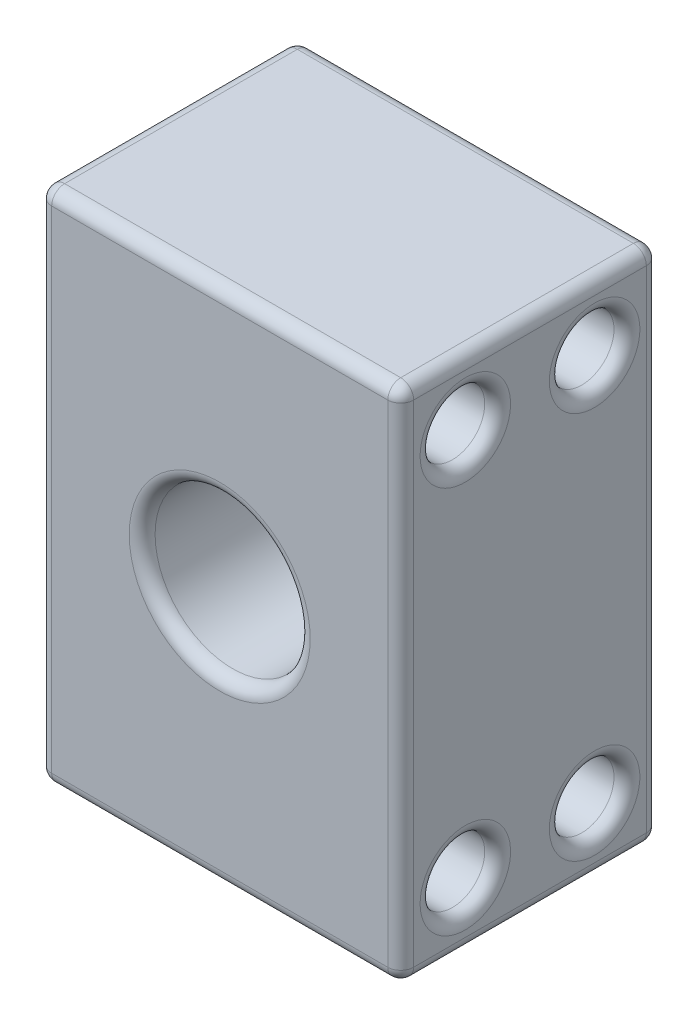
ISO-10303-21;
HEADER;
FILE_DESCRIPTION(('STEP AP214'),'2;1');
FILE_NAME('part.step','',(''),(''),'','','');
FILE_SCHEMA(('AUTOMOTIVE_DESIGN { 1 0 10303 214 1 1 1 1 }'));
ENDSEC;
DATA;
#1=APPLICATION_CONTEXT('core data for automotive mechanical design processes');
#2=APPLICATION_PROTOCOL_DEFINITION('international standard','automotive_design',2000,#1);
#3=PRODUCT_CONTEXT('',#1,'mechanical');
#4=PRODUCT('Part','Part','',(#3));
#5=PRODUCT_RELATED_PRODUCT_CATEGORY('part','',(#4));
#6=PRODUCT_DEFINITION_FORMATION('','',#4);
#7=PRODUCT_DEFINITION_CONTEXT('part definition',#1,'design');
#8=PRODUCT_DEFINITION('design','',#6,#7);
#9=PRODUCT_DEFINITION_SHAPE('','',#8);
#10=(LENGTH_UNIT() NAMED_UNIT(*) SI_UNIT(.MILLI.,.METRE.));
#11=(NAMED_UNIT(*) PLANE_ANGLE_UNIT() SI_UNIT($,.RADIAN.));
#12=(NAMED_UNIT(*) SI_UNIT($,.STERADIAN.) SOLID_ANGLE_UNIT());
#13=UNCERTAINTY_MEASURE_WITH_UNIT(LENGTH_MEASURE(1.E-05),#10,'distance_accuracy_value','');
#14=(GEOMETRIC_REPRESENTATION_CONTEXT(3) GLOBAL_UNCERTAINTY_ASSIGNED_CONTEXT((#13)) GLOBAL_UNIT_ASSIGNED_CONTEXT((#10,
#11,#12)) REPRESENTATION_CONTEXT('',''));
#15=CARTESIAN_POINT('',(0.,0.,0.));
#16=DIRECTION('',(0.,0.,1.));
#17=DIRECTION('',(1.,0.,0.));
#18=AXIS2_PLACEMENT_3D('',#15,#16,#17);
#19=CARTESIAN_POINT('',(0.,0.,20.));
#20=DIRECTION('',(1.,0.,0.));
#21=DIRECTION('',(0.,0.,-1.));
#22=AXIS2_PLACEMENT_3D('',#19,#20,#21);
#23=PLANE('',#22);
#24=CARTESIAN_POINT('',(0.,35.,15.));
#25=DIRECTION('',(1.,0.,0.));
#26=DIRECTION('',(0.,0.,-1.));
#27=AXIS2_PLACEMENT_3D('',#24,#25,#26);
#28=CIRCLE('',#27,3.5);
#29=CARTESIAN_POINT('',(0.,35.,11.5));
#30=VERTEX_POINT('',#29);
#31=EDGE_CURVE('E171',#30,#30,#28,.T.);
#32=ORIENTED_EDGE('',*,*,#31,.T.);
#33=EDGE_LOOP('',(#32));
#34=FACE_BOUND('',#33,.T.);
#35=CARTESIAN_POINT('',(0.,35.,5.));
#36=DIRECTION('',(1.,0.,0.));
#37=DIRECTION('',(0.,0.,-1.));
#38=AXIS2_PLACEMENT_3D('',#35,#36,#37);
#39=CIRCLE('',#38,3.5);
#40=CARTESIAN_POINT('',(0.,35.,1.5));
#41=VERTEX_POINT('',#40);
#42=EDGE_CURVE('E168',#41,#41,#39,.T.);
#43=ORIENTED_EDGE('',*,*,#42,.T.);
#44=EDGE_LOOP('',(#43));
#45=FACE_BOUND('',#44,.T.);
#46=CARTESIAN_POINT('',(0.,5.,5.));
#47=DIRECTION('',(1.,0.,0.));
#48=DIRECTION('',(0.,0.,-1.));
#49=AXIS2_PLACEMENT_3D('',#46,#47,#48);
#50=CIRCLE('',#49,3.5);
#51=CARTESIAN_POINT('',(0.,5.,1.5));
#52=VERTEX_POINT('',#51);
#53=EDGE_CURVE('E165',#52,#52,#50,.T.);
#54=ORIENTED_EDGE('',*,*,#53,.T.);
#55=EDGE_LOOP('',(#54));
#56=FACE_BOUND('',#55,.T.);
#57=CARTESIAN_POINT('',(0.,5.,15.));
#58=DIRECTION('',(1.,0.,0.));
#59=DIRECTION('',(0.,0.,-1.));
#60=AXIS2_PLACEMENT_3D('',#57,#58,#59);
#61=CIRCLE('',#60,3.5);
#62=CARTESIAN_POINT('',(0.,5.,11.5));
#63=VERTEX_POINT('',#62);
#64=EDGE_CURVE('E159',#63,#63,#61,.T.);
#65=ORIENTED_EDGE('',*,*,#64,.T.);
#66=EDGE_LOOP('',(#65));
#67=FACE_BOUND('',#66,.T.);
#68=DIRECTION('',(0.,-1.,0.));
#69=VECTOR('',#68,1.);
#70=CARTESIAN_POINT('',(0.,0.,1.));
#71=LINE('',#70,#69);
#72=CARTESIAN_POINT('',(0.,39.,1.));
#73=VERTEX_POINT('',#72);
#74=CARTESIAN_POINT('',(0.,1.,1.));
#75=VERTEX_POINT('',#74);
#76=EDGE_CURVE('E154',#73,#75,#71,.T.);
#77=ORIENTED_EDGE('',*,*,#76,.T.);
#78=DIRECTION('',(0.,0.,-1.));
#79=VECTOR('',#78,1.);
#80=CARTESIAN_POINT('',(0.,1.,20.));
#81=LINE('',#80,#79);
#82=CARTESIAN_POINT('',(0.,1.,19.));
#83=VERTEX_POINT('',#82);
#84=EDGE_CURVE('E157',#75,#83,#81,.F.);
#85=ORIENTED_EDGE('',*,*,#84,.T.);
#86=DIRECTION('',(0.,-1.,0.));
#87=VECTOR('',#86,1.);
#88=CARTESIAN_POINT('',(0.,0.,19.));
#89=LINE('',#88,#87);
#90=CARTESIAN_POINT('',(0.,39.,19.));
#91=VERTEX_POINT('',#90);
#92=EDGE_CURVE('E142',#83,#91,#89,.F.);
#93=ORIENTED_EDGE('',*,*,#92,.T.);
#94=DIRECTION('',(0.,0.,-1.));
#95=VECTOR('',#94,1.);
#96=CARTESIAN_POINT('',(0.,39.,20.));
#97=LINE('',#96,#95);
#98=EDGE_CURVE('E148',#91,#73,#97,.T.);
#99=ORIENTED_EDGE('',*,*,#98,.T.);
#100=EDGE_LOOP('',(#77,#85,#93,#99));
#101=FACE_BOUND('',#100,.T.);
#102=ADVANCED_FACE('F37',(#34,#45,#56,#67,#101),#23,.F.);
#103=CARTESIAN_POINT('',(0.,0.,20.));
#104=DIRECTION('',(0.,1.,0.));
#105=DIRECTION('',(0.,0.,1.));
#106=AXIS2_PLACEMENT_3D('',#103,#104,#105);
#107=PLANE('',#106);
#108=DIRECTION('',(1.,0.,0.));
#109=VECTOR('',#108,1.);
#110=CARTESIAN_POINT('',(0.,0.,19.));
#111=LINE('',#110,#109);
#112=CARTESIAN_POINT('',(27.,0.,19.));
#113=VERTEX_POINT('',#112);
#114=CARTESIAN_POINT('',(1.,0.,19.));
#115=VERTEX_POINT('',#114);
#116=EDGE_CURVE('E252',#113,#115,#111,.F.);
#117=ORIENTED_EDGE('',*,*,#116,.T.);
#118=DIRECTION('',(0.,0.,-1.));
#119=VECTOR('',#118,1.);
#120=CARTESIAN_POINT('',(1.,0.,20.));
#121=LINE('',#120,#119);
#122=CARTESIAN_POINT('',(1.,0.,1.));
#123=VERTEX_POINT('',#122);
#124=EDGE_CURVE('E254',#115,#123,#121,.T.);
#125=ORIENTED_EDGE('',*,*,#124,.T.);
#126=DIRECTION('',(1.,0.,0.));
#127=VECTOR('',#126,1.);
#128=CARTESIAN_POINT('',(28.,0.,1.));
#129=LINE('',#128,#127);
#130=CARTESIAN_POINT('',(27.,0.,1.));
#131=VERTEX_POINT('',#130);
#132=EDGE_CURVE('E248',#123,#131,#129,.T.);
#133=ORIENTED_EDGE('',*,*,#132,.T.);
#134=DIRECTION('',(0.,0.,-1.));
#135=VECTOR('',#134,1.);
#136=CARTESIAN_POINT('',(27.,0.,20.));
#137=LINE('',#136,#135);
#138=EDGE_CURVE('E250',#131,#113,#137,.F.);
#139=ORIENTED_EDGE('',*,*,#138,.T.);
#140=EDGE_LOOP('',(#117,#125,#133,#139));
#141=FACE_BOUND('',#140,.T.);
#142=ADVANCED_FACE('F329',(#141),#107,.F.);
#143=CARTESIAN_POINT('',(28.,0.,20.));
#144=DIRECTION('',(-1.,0.,0.));
#145=DIRECTION('',(0.,0.,1.));
#146=AXIS2_PLACEMENT_3D('',#143,#144,#145);
#147=PLANE('',#146);
#148=CARTESIAN_POINT('',(28.,35.,15.));
#149=DIRECTION('',(-1.,0.,0.));
#150=DIRECTION('',(0.,0.,1.));
#151=AXIS2_PLACEMENT_3D('',#148,#149,#150);
#152=CIRCLE('',#151,3.5);
#153=CARTESIAN_POINT('',(28.,35.,18.5));
#154=VERTEX_POINT('',#153);
#155=EDGE_CURVE('E216',#154,#154,#152,.T.);
#156=ORIENTED_EDGE('',*,*,#155,.T.);
#157=EDGE_LOOP('',(#156));
#158=FACE_BOUND('',#157,.T.);
#159=CARTESIAN_POINT('',(28.,35.,5.));
#160=DIRECTION('',(-1.,0.,0.));
#161=DIRECTION('',(0.,0.,1.));
#162=AXIS2_PLACEMENT_3D('',#159,#160,#161);
#163=CIRCLE('',#162,3.5);
#164=CARTESIAN_POINT('',(28.,35.,8.5));
#165=VERTEX_POINT('',#164);
#166=EDGE_CURVE('E213',#165,#165,#163,.T.);
#167=ORIENTED_EDGE('',*,*,#166,.T.);
#168=EDGE_LOOP('',(#167));
#169=FACE_BOUND('',#168,.T.);
#170=CARTESIAN_POINT('',(28.,5.,5.));
#171=DIRECTION('',(-1.,0.,0.));
#172=DIRECTION('',(0.,0.,1.));
#173=AXIS2_PLACEMENT_3D('',#170,#171,#172);
#174=CIRCLE('',#173,3.5);
#175=CARTESIAN_POINT('',(28.,5.,8.5));
#176=VERTEX_POINT('',#175);
#177=EDGE_CURVE('E210',#176,#176,#174,.T.);
#178=ORIENTED_EDGE('',*,*,#177,.T.);
#179=EDGE_LOOP('',(#178));
#180=FACE_BOUND('',#179,.T.);
#181=CARTESIAN_POINT('',(28.,5.,15.));
#182=DIRECTION('',(-1.,0.,0.));
#183=DIRECTION('',(0.,0.,1.));
#184=AXIS2_PLACEMENT_3D('',#181,#182,#183);
#185=CIRCLE('',#184,3.5);
#186=CARTESIAN_POINT('',(28.,5.,18.5));
#187=VERTEX_POINT('',#186);
#188=EDGE_CURVE('E207',#187,#187,#185,.T.);
#189=ORIENTED_EDGE('',*,*,#188,.T.);
#190=EDGE_LOOP('',(#189));
#191=FACE_BOUND('',#190,.T.);
#192=DIRECTION('',(0.,1.,0.));
#193=VECTOR('',#192,1.);
#194=CARTESIAN_POINT('',(28.,0.,19.));
#195=LINE('',#194,#193);
#196=CARTESIAN_POINT('',(28.,39.,19.));
#197=VERTEX_POINT('',#196);
#198=CARTESIAN_POINT('',(28.,1.,19.));
#199=VERTEX_POINT('',#198);
#200=EDGE_CURVE('E202',#197,#199,#195,.F.);
#201=ORIENTED_EDGE('',*,*,#200,.T.);
#202=DIRECTION('',(0.,0.,-1.));
#203=VECTOR('',#202,1.);
#204=CARTESIAN_POINT('',(28.,1.,20.));
#205=LINE('',#204,#203);
#206=CARTESIAN_POINT('',(28.,1.,1.));
#207=VERTEX_POINT('',#206);
#208=EDGE_CURVE('E205',#199,#207,#205,.T.);
#209=ORIENTED_EDGE('',*,*,#208,.T.);
#210=DIRECTION('',(0.,1.,0.));
#211=VECTOR('',#210,1.);
#212=CARTESIAN_POINT('',(28.,40.,1.));
#213=LINE('',#212,#211);
#214=CARTESIAN_POINT('',(28.,39.,1.));
#215=VERTEX_POINT('',#214);
#216=EDGE_CURVE('E200',#207,#215,#213,.T.);
#217=ORIENTED_EDGE('',*,*,#216,.T.);
#218=DIRECTION('',(0.,0.,-1.));
#219=VECTOR('',#218,1.);
#220=CARTESIAN_POINT('',(28.,39.,20.));
#221=LINE('',#220,#219);
#222=EDGE_CURVE('E198',#215,#197,#221,.F.);
#223=ORIENTED_EDGE('',*,*,#222,.T.);
#224=EDGE_LOOP('',(#201,#209,#217,#223));
#225=FACE_BOUND('',#224,.T.);
#226=ADVANCED_FACE('F362',(#158,#169,#180,#191,#225),#147,.F.);
#227=CARTESIAN_POINT('',(0.,40.,20.));
#228=DIRECTION('',(0.,-1.,0.));
#229=DIRECTION('',(0.,0.,-1.));
#230=AXIS2_PLACEMENT_3D('',#227,#228,#229);
#231=PLANE('',#230);
#232=DIRECTION('',(-1.,0.,0.));
#233=VECTOR('',#232,1.);
#234=CARTESIAN_POINT('',(0.,40.,19.));
#235=LINE('',#234,#233);
#236=CARTESIAN_POINT('',(1.,40.,19.));
#237=VERTEX_POINT('',#236);
#238=CARTESIAN_POINT('',(27.,40.,19.));
#239=VERTEX_POINT('',#238);
#240=EDGE_CURVE('E46',#237,#239,#235,.F.);
#241=ORIENTED_EDGE('',*,*,#240,.T.);
#242=DIRECTION('',(0.,0.,-1.));
#243=VECTOR('',#242,1.);
#244=CARTESIAN_POINT('',(27.,40.,20.));
#245=LINE('',#244,#243);
#246=CARTESIAN_POINT('',(27.,40.,1.));
#247=VERTEX_POINT('',#246);
#248=EDGE_CURVE('E11',#239,#247,#245,.T.);
#249=ORIENTED_EDGE('',*,*,#248,.T.);
#250=DIRECTION('',(-1.,0.,0.));
#251=VECTOR('',#250,1.);
#252=CARTESIAN_POINT('',(0.,40.,1.));
#253=LINE('',#252,#251);
#254=CARTESIAN_POINT('',(1.,40.,1.));
#255=VERTEX_POINT('',#254);
#256=EDGE_CURVE('E257',#247,#255,#253,.T.);
#257=ORIENTED_EDGE('',*,*,#256,.T.);
#258=DIRECTION('',(0.,0.,-1.));
#259=VECTOR('',#258,1.);
#260=CARTESIAN_POINT('',(1.,40.,20.));
#261=LINE('',#260,#259);
#262=EDGE_CURVE('E57',#255,#237,#261,.F.);
#263=ORIENTED_EDGE('',*,*,#262,.T.);
#264=EDGE_LOOP('',(#241,#249,#257,#263));
#265=FACE_BOUND('',#264,.T.);
#266=ADVANCED_FACE('F378',(#265),#231,.F.);
#267=CARTESIAN_POINT('',(0.,0.,20.));
#268=DIRECTION('',(0.,0.,-1.));
#269=DIRECTION('',(-1.,0.,0.));
#270=AXIS2_PLACEMENT_3D('',#267,#268,#269);
#271=PLANE('',#270);
#272=CARTESIAN_POINT('',(14.,20.,20.));
#273=DIRECTION('',(0.,0.,-1.));
#274=DIRECTION('',(-1.,0.,0.));
#275=AXIS2_PLACEMENT_3D('',#272,#273,#274);
#276=CIRCLE('',#275,7.);
#277=CARTESIAN_POINT('',(7.,20.,20.));
#278=VERTEX_POINT('',#277);
#279=EDGE_CURVE('E236',#278,#278,#276,.T.);
#280=ORIENTED_EDGE('',*,*,#279,.T.);
#281=EDGE_LOOP('',(#280));
#282=FACE_BOUND('',#281,.T.);
#283=DIRECTION('',(0.,-1.,0.));
#284=VECTOR('',#283,1.);
#285=CARTESIAN_POINT('',(1.,0.,20.));
#286=LINE('',#285,#284);
#287=CARTESIAN_POINT('',(1.,39.,20.));
#288=VERTEX_POINT('',#287);
#289=CARTESIAN_POINT('',(1.,1.,20.));
#290=VERTEX_POINT('',#289);
#291=EDGE_CURVE('E144',#288,#290,#286,.T.);
#292=ORIENTED_EDGE('',*,*,#291,.T.);
#293=DIRECTION('',(1.,0.,0.));
#294=VECTOR('',#293,1.);
#295=CARTESIAN_POINT('',(0.,1.,20.));
#296=LINE('',#295,#294);
#297=CARTESIAN_POINT('',(27.,1.,20.));
#298=VERTEX_POINT('',#297);
#299=EDGE_CURVE('E234',#290,#298,#296,.T.);
#300=ORIENTED_EDGE('',*,*,#299,.T.);
#301=DIRECTION('',(0.,1.,0.));
#302=VECTOR('',#301,1.);
#303=CARTESIAN_POINT('',(27.,0.,20.));
#304=LINE('',#303,#302);
#305=CARTESIAN_POINT('',(27.,39.,20.));
#306=VERTEX_POINT('',#305);
#307=EDGE_CURVE('E231',#298,#306,#304,.T.);
#308=ORIENTED_EDGE('',*,*,#307,.T.);
#309=DIRECTION('',(-1.,0.,0.));
#310=VECTOR('',#309,1.);
#311=CARTESIAN_POINT('',(0.,39.,20.));
#312=LINE('',#311,#310);
#313=EDGE_CURVE('E228',#306,#288,#312,.T.);
#314=ORIENTED_EDGE('',*,*,#313,.T.);
#315=EDGE_LOOP('',(#292,#300,#308,#314));
#316=FACE_BOUND('',#315,.T.);
#317=ADVANCED_FACE('F345',(#282,#316),#271,.F.);
#318=CARTESIAN_POINT('',(0.,0.,0.));
#319=DIRECTION('',(0.,0.,-1.));
#320=DIRECTION('',(-1.,0.,0.));
#321=AXIS2_PLACEMENT_3D('',#318,#319,#320);
#322=PLANE('',#321);
#323=DIRECTION('',(0.,1.,0.));
#324=VECTOR('',#323,1.);
#325=CARTESIAN_POINT('',(27.,0.,0.));
#326=LINE('',#325,#324);
#327=CARTESIAN_POINT('',(27.,39.,0.));
#328=VERTEX_POINT('',#327);
#329=CARTESIAN_POINT('',(27.,1.,0.));
#330=VERTEX_POINT('',#329);
#331=EDGE_CURVE('E243',#328,#330,#326,.F.);
#332=ORIENTED_EDGE('',*,*,#331,.T.);
#333=DIRECTION('',(1.,0.,0.));
#334=VECTOR('',#333,1.);
#335=CARTESIAN_POINT('',(0.,1.,0.));
#336=LINE('',#335,#334);
#337=CARTESIAN_POINT('',(1.,1.,0.));
#338=VERTEX_POINT('',#337);
#339=EDGE_CURVE('E246',#330,#338,#336,.F.);
#340=ORIENTED_EDGE('',*,*,#339,.T.);
#341=DIRECTION('',(0.,-1.,0.));
#342=VECTOR('',#341,1.);
#343=CARTESIAN_POINT('',(1.,40.,0.));
#344=LINE('',#343,#342);
#345=CARTESIAN_POINT('',(1.,39.,0.));
#346=VERTEX_POINT('',#345);
#347=EDGE_CURVE('E241',#338,#346,#344,.F.);
#348=ORIENTED_EDGE('',*,*,#347,.T.);
#349=DIRECTION('',(-1.,0.,0.));
#350=VECTOR('',#349,1.);
#351=CARTESIAN_POINT('',(28.,39.,0.));
#352=LINE('',#351,#350);
#353=EDGE_CURVE('E239',#346,#328,#352,.F.);
#354=ORIENTED_EDGE('',*,*,#353,.T.);
#355=EDGE_LOOP('',(#332,#340,#348,#354));
#356=FACE_BOUND('',#355,.T.);
#357=ADVANCED_FACE('F385',(#356),#322,.T.);
#358=CARTESIAN_POINT('',(14.,20.,8.));
#359=DIRECTION('',(0.,0.,1.));
#360=DIRECTION('',(1.,0.,0.));
#361=AXIS2_PLACEMENT_3D('',#358,#359,#360);
#362=CYLINDRICAL_SURFACE('',#361,6.);
#363=CARTESIAN_POINT('',(14.,20.,9.));
#364=DIRECTION('',(0.,0.,1.));
#365=DIRECTION('',(1.,0.,0.));
#366=AXIS2_PLACEMENT_3D('',#363,#364,#365);
#367=CIRCLE('',#366,6.);
#368=CARTESIAN_POINT('',(20.,20.,9.));
#369=VERTEX_POINT('',#368);
#370=EDGE_CURVE('E225',#369,#369,#367,.F.);
#371=ORIENTED_EDGE('',*,*,#370,.T.);
#372=EDGE_LOOP('',(#371));
#373=FACE_BOUND('',#372,.T.);
#374=CARTESIAN_POINT('',(14.,20.,19.));
#375=DIRECTION('',(0.,0.,-1.));
#376=DIRECTION('',(-1.,0.,0.));
#377=AXIS2_PLACEMENT_3D('',#374,#375,#376);
#378=CIRCLE('',#377,6.);
#379=CARTESIAN_POINT('',(8.,20.,19.));
#380=VERTEX_POINT('',#379);
#381=EDGE_CURVE('E222',#380,#380,#378,.F.);
#382=ORIENTED_EDGE('',*,*,#381,.T.);
#383=EDGE_LOOP('',(#382));
#384=FACE_BOUND('',#383,.T.);
#385=ADVANCED_FACE('F699',(#373,#384),#362,.F.);
#386=CARTESIAN_POINT('',(14.,20.,8.));
#387=DIRECTION('',(0.,0.,1.));
#388=DIRECTION('',(1.,0.,0.));
#389=AXIS2_PLACEMENT_3D('',#386,#387,#388);
#390=PLANE('',#389);
#391=CARTESIAN_POINT('',(14.,20.,8.));
#392=DIRECTION('',(0.,0.,1.));
#393=DIRECTION('',(1.,0.,0.));
#394=AXIS2_PLACEMENT_3D('',#391,#392,#393);
#395=CIRCLE('',#394,5.);
#396=CARTESIAN_POINT('',(19.,20.,8.));
#397=VERTEX_POINT('',#396);
#398=EDGE_CURVE('E219',#397,#397,#395,.T.);
#399=ORIENTED_EDGE('',*,*,#398,.T.);
#400=EDGE_LOOP('',(#399));
#401=FACE_BOUND('',#400,.T.);
#402=ADVANCED_FACE('F690',(#401),#390,.T.);
#403=CARTESIAN_POINT('',(0.,35.,15.));
#404=DIRECTION('',(1.,0.,0.));
#405=DIRECTION('',(0.,0.,-1.));
#406=AXIS2_PLACEMENT_3D('',#403,#404,#405);
#407=CYLINDRICAL_SURFACE('',#406,2.5);
#408=CARTESIAN_POINT('',(1.,35.,15.));
#409=DIRECTION('',(1.,0.,0.));
#410=DIRECTION('',(0.,0.,-1.));
#411=AXIS2_PLACEMENT_3D('',#408,#409,#410);
#412=CIRCLE('',#411,2.5);
#413=CARTESIAN_POINT('',(1.,35.,12.5));
#414=VERTEX_POINT('',#413);
#415=EDGE_CURVE('E177',#414,#414,#412,.F.);
#416=ORIENTED_EDGE('',*,*,#415,.T.);
#417=EDGE_LOOP('',(#416));
#418=FACE_BOUND('',#417,.T.);
#419=CARTESIAN_POINT('',(27.,35.,15.));
#420=DIRECTION('',(-1.,0.,0.));
#421=DIRECTION('',(0.,0.,1.));
#422=AXIS2_PLACEMENT_3D('',#419,#420,#421);
#423=CIRCLE('',#422,2.5);
#424=CARTESIAN_POINT('',(27.,35.,17.5));
#425=VERTEX_POINT('',#424);
#426=EDGE_CURVE('E174',#425,#425,#423,.F.);
#427=ORIENTED_EDGE('',*,*,#426,.T.);
#428=EDGE_LOOP('',(#427));
#429=FACE_BOUND('',#428,.T.);
#430=ADVANCED_FACE('F681',(#418,#429),#407,.F.);
#431=CARTESIAN_POINT('',(0.,35.,5.));
#432=DIRECTION('',(1.,0.,0.));
#433=DIRECTION('',(0.,0.,-1.));
#434=AXIS2_PLACEMENT_3D('',#431,#432,#433);
#435=CYLINDRICAL_SURFACE('',#434,2.5);
#436=CARTESIAN_POINT('',(1.,35.,5.));
#437=DIRECTION('',(1.,0.,0.));
#438=DIRECTION('',(0.,0.,-1.));
#439=AXIS2_PLACEMENT_3D('',#436,#437,#438);
#440=CIRCLE('',#439,2.5);
#441=CARTESIAN_POINT('',(1.,35.,2.5));
#442=VERTEX_POINT('',#441);
#443=EDGE_CURVE('E183',#442,#442,#440,.F.);
#444=ORIENTED_EDGE('',*,*,#443,.T.);
#445=EDGE_LOOP('',(#444));
#446=FACE_BOUND('',#445,.T.);
#447=CARTESIAN_POINT('',(27.,35.,5.));
#448=DIRECTION('',(-1.,0.,0.));
#449=DIRECTION('',(0.,0.,1.));
#450=AXIS2_PLACEMENT_3D('',#447,#448,#449);
#451=CIRCLE('',#450,2.5);
#452=CARTESIAN_POINT('',(27.,35.,7.5));
#453=VERTEX_POINT('',#452);
#454=EDGE_CURVE('E180',#453,#453,#451,.F.);
#455=ORIENTED_EDGE('',*,*,#454,.T.);
#456=EDGE_LOOP('',(#455));
#457=FACE_BOUND('',#456,.T.);
#458=ADVANCED_FACE('F672',(#446,#457),#435,.F.);
#459=CARTESIAN_POINT('',(0.,5.,5.));
#460=DIRECTION('',(1.,0.,0.));
#461=DIRECTION('',(0.,0.,-1.));
#462=AXIS2_PLACEMENT_3D('',#459,#460,#461);
#463=CYLINDRICAL_SURFACE('',#462,2.5);
#464=CARTESIAN_POINT('',(1.,5.,5.));
#465=DIRECTION('',(1.,0.,0.));
#466=DIRECTION('',(0.,0.,-1.));
#467=AXIS2_PLACEMENT_3D('',#464,#465,#466);
#468=CIRCLE('',#467,2.5);
#469=CARTESIAN_POINT('',(1.,5.,2.5));
#470=VERTEX_POINT('',#469);
#471=EDGE_CURVE('E189',#470,#470,#468,.F.);
#472=ORIENTED_EDGE('',*,*,#471,.T.);
#473=EDGE_LOOP('',(#472));
#474=FACE_BOUND('',#473,.T.);
#475=CARTESIAN_POINT('',(27.,5.,5.));
#476=DIRECTION('',(-1.,0.,0.));
#477=DIRECTION('',(0.,0.,1.));
#478=AXIS2_PLACEMENT_3D('',#475,#476,#477);
#479=CIRCLE('',#478,2.5);
#480=CARTESIAN_POINT('',(27.,5.,7.5));
#481=VERTEX_POINT('',#480);
#482=EDGE_CURVE('E186',#481,#481,#479,.F.);
#483=ORIENTED_EDGE('',*,*,#482,.T.);
#484=EDGE_LOOP('',(#483));
#485=FACE_BOUND('',#484,.T.);
#486=ADVANCED_FACE('F663',(#474,#485),#463,.F.);
#487=CARTESIAN_POINT('',(0.,5.,15.));
#488=DIRECTION('',(1.,0.,0.));
#489=DIRECTION('',(0.,0.,-1.));
#490=AXIS2_PLACEMENT_3D('',#487,#488,#489);
#491=CYLINDRICAL_SURFACE('',#490,2.5);
#492=CARTESIAN_POINT('',(1.,5.,15.));
#493=DIRECTION('',(1.,0.,0.));
#494=DIRECTION('',(0.,0.,-1.));
#495=AXIS2_PLACEMENT_3D('',#492,#493,#494);
#496=CIRCLE('',#495,2.5);
#497=CARTESIAN_POINT('',(1.,5.,12.5));
#498=VERTEX_POINT('',#497);
#499=EDGE_CURVE('E195',#498,#498,#496,.F.);
#500=ORIENTED_EDGE('',*,*,#499,.T.);
#501=EDGE_LOOP('',(#500));
#502=FACE_BOUND('',#501,.T.);
#503=CARTESIAN_POINT('',(27.,5.,15.));
#504=DIRECTION('',(-1.,0.,0.));
#505=DIRECTION('',(0.,0.,1.));
#506=AXIS2_PLACEMENT_3D('',#503,#504,#505);
#507=CIRCLE('',#506,2.5);
#508=CARTESIAN_POINT('',(27.,5.,17.5));
#509=VERTEX_POINT('',#508);
#510=EDGE_CURVE('E192',#509,#509,#507,.F.);
#511=ORIENTED_EDGE('',*,*,#510,.T.);
#512=EDGE_LOOP('',(#511));
#513=FACE_BOUND('',#512,.T.);
#514=ADVANCED_FACE('F404',(#502,#513),#491,.F.);
#515=CARTESIAN_POINT('',(1.,35.,15.));
#516=DIRECTION('',(1.,0.,0.));
#517=DIRECTION('',(0.,0.,-1.));
#518=AXIS2_PLACEMENT_3D('',#515,#516,#517);
#519=TOROIDAL_SURFACE('',#518,3.5,1.);
#520=ORIENTED_EDGE('',*,*,#415,.F.);
#521=EDGE_LOOP('',(#520));
#522=FACE_BOUND('',#521,.T.);
#523=ORIENTED_EDGE('',*,*,#31,.F.);
#524=EDGE_LOOP('',(#523));
#525=FACE_BOUND('',#524,.T.);
#526=ADVANCED_FACE('F400',(#522,#525),#519,.T.);
#527=CARTESIAN_POINT('',(1.,35.,5.));
#528=DIRECTION('',(1.,0.,0.));
#529=DIRECTION('',(0.,0.,-1.));
#530=AXIS2_PLACEMENT_3D('',#527,#528,#529);
#531=TOROIDAL_SURFACE('',#530,3.5,1.);
#532=ORIENTED_EDGE('',*,*,#443,.F.);
#533=EDGE_LOOP('',(#532));
#534=FACE_BOUND('',#533,.T.);
#535=ORIENTED_EDGE('',*,*,#42,.F.);
#536=EDGE_LOOP('',(#535));
#537=FACE_BOUND('',#536,.T.);
#538=ADVANCED_FACE('F403',(#534,#537),#531,.T.);
#539=CARTESIAN_POINT('',(1.,5.,5.));
#540=DIRECTION('',(1.,0.,0.));
#541=DIRECTION('',(0.,0.,-1.));
#542=AXIS2_PLACEMENT_3D('',#539,#540,#541);
#543=TOROIDAL_SURFACE('',#542,3.5,1.);
#544=ORIENTED_EDGE('',*,*,#471,.F.);
#545=EDGE_LOOP('',(#544));
#546=FACE_BOUND('',#545,.T.);
#547=ORIENTED_EDGE('',*,*,#53,.F.);
#548=EDGE_LOOP('',(#547));
#549=FACE_BOUND('',#548,.T.);
#550=ADVANCED_FACE('F408',(#546,#549),#543,.T.);
#551=CARTESIAN_POINT('',(1.,5.,15.));
#552=DIRECTION('',(1.,0.,0.));
#553=DIRECTION('',(0.,0.,-1.));
#554=AXIS2_PLACEMENT_3D('',#551,#552,#553);
#555=TOROIDAL_SURFACE('',#554,3.5,1.);
#556=ORIENTED_EDGE('',*,*,#499,.F.);
#557=EDGE_LOOP('',(#556));
#558=FACE_BOUND('',#557,.T.);
#559=ORIENTED_EDGE('',*,*,#64,.F.);
#560=EDGE_LOOP('',(#559));
#561=FACE_BOUND('',#560,.T.);
#562=ADVANCED_FACE('F412',(#558,#561),#555,.T.);
#563=CARTESIAN_POINT('',(27.,35.,15.));
#564=DIRECTION('',(-1.,0.,0.));
#565=DIRECTION('',(0.,0.,1.));
#566=AXIS2_PLACEMENT_3D('',#563,#564,#565);
#567=TOROIDAL_SURFACE('',#566,3.5,1.);
#568=ORIENTED_EDGE('',*,*,#155,.F.);
#569=EDGE_LOOP('',(#568));
#570=FACE_BOUND('',#569,.T.);
#571=ORIENTED_EDGE('',*,*,#426,.F.);
#572=EDGE_LOOP('',(#571));
#573=FACE_BOUND('',#572,.T.);
#574=ADVANCED_FACE('F416',(#570,#573),#567,.T.);
#575=CARTESIAN_POINT('',(27.,35.,5.));
#576=DIRECTION('',(-1.,0.,0.));
#577=DIRECTION('',(0.,0.,1.));
#578=AXIS2_PLACEMENT_3D('',#575,#576,#577);
#579=TOROIDAL_SURFACE('',#578,3.5,1.);
#580=ORIENTED_EDGE('',*,*,#166,.F.);
#581=EDGE_LOOP('',(#580));
#582=FACE_BOUND('',#581,.T.);
#583=ORIENTED_EDGE('',*,*,#454,.F.);
#584=EDGE_LOOP('',(#583));
#585=FACE_BOUND('',#584,.T.);
#586=ADVANCED_FACE('F420',(#582,#585),#579,.T.);
#587=CARTESIAN_POINT('',(27.,5.,5.));
#588=DIRECTION('',(-1.,0.,0.));
#589=DIRECTION('',(0.,0.,1.));
#590=AXIS2_PLACEMENT_3D('',#587,#588,#589);
#591=TOROIDAL_SURFACE('',#590,3.5,1.);
#592=ORIENTED_EDGE('',*,*,#177,.F.);
#593=EDGE_LOOP('',(#592));
#594=FACE_BOUND('',#593,.T.);
#595=ORIENTED_EDGE('',*,*,#482,.F.);
#596=EDGE_LOOP('',(#595));
#597=FACE_BOUND('',#596,.T.);
#598=ADVANCED_FACE('F424',(#594,#597),#591,.T.);
#599=CARTESIAN_POINT('',(27.,5.,15.));
#600=DIRECTION('',(-1.,0.,0.));
#601=DIRECTION('',(0.,0.,1.));
#602=AXIS2_PLACEMENT_3D('',#599,#600,#601);
#603=TOROIDAL_SURFACE('',#602,3.5,1.);
#604=ORIENTED_EDGE('',*,*,#188,.F.);
#605=EDGE_LOOP('',(#604));
#606=FACE_BOUND('',#605,.T.);
#607=ORIENTED_EDGE('',*,*,#510,.F.);
#608=EDGE_LOOP('',(#607));
#609=FACE_BOUND('',#608,.T.);
#610=ADVANCED_FACE('F428',(#606,#609),#603,.T.);
#611=CARTESIAN_POINT('',(14.,20.,9.));
#612=DIRECTION('',(0.,0.,1.));
#613=DIRECTION('',(1.,0.,0.));
#614=AXIS2_PLACEMENT_3D('',#611,#612,#613);
#615=TOROIDAL_SURFACE('',#614,5.,1.);
#616=ORIENTED_EDGE('',*,*,#370,.F.);
#617=EDGE_LOOP('',(#616));
#618=FACE_BOUND('',#617,.T.);
#619=ORIENTED_EDGE('',*,*,#398,.F.);
#620=EDGE_LOOP('',(#619));
#621=FACE_BOUND('',#620,.T.);
#622=ADVANCED_FACE('F432',(#618,#621),#615,.F.);
#623=CARTESIAN_POINT('',(1.,0.,1.));
#624=DIRECTION('',(0.,1.,0.));
#625=DIRECTION('',(0.,0.,1.));
#626=AXIS2_PLACEMENT_3D('',#623,#624,#625);
#627=CYLINDRICAL_SURFACE('',#626,1.);
#628=CARTESIAN_POINT('',(1.,1.,1.));
#629=DIRECTION('',(0.,-1.,0.));
#630=DIRECTION('',(0.,0.,-1.));
#631=AXIS2_PLACEMENT_3D('',#628,#629,#630);
#632=CIRCLE('',#631,1.);
#633=EDGE_CURVE('E41',#75,#338,#632,.T.);
#634=ORIENTED_EDGE('',*,*,#633,.F.);
#635=ORIENTED_EDGE('',*,*,#76,.F.);
#636=CARTESIAN_POINT('',(1.,39.,1.));
#637=DIRECTION('',(0.,1.,0.));
#638=DIRECTION('',(0.,0.,1.));
#639=AXIS2_PLACEMENT_3D('',#636,#637,#638);
#640=CIRCLE('',#639,1.);
#641=EDGE_CURVE('E310',#346,#73,#640,.T.);
#642=ORIENTED_EDGE('',*,*,#641,.F.);
#643=ORIENTED_EDGE('',*,*,#347,.F.);
#644=EDGE_LOOP('',(#634,#635,#642,#643));
#645=FACE_BOUND('',#644,.T.);
#646=ADVANCED_FACE('F436',(#645),#627,.T.);
#647=CARTESIAN_POINT('',(1.,1.,1.));
#648=DIRECTION('',(0.,0.,1.));
#649=DIRECTION('',(1.,0.,0.));
#650=AXIS2_PLACEMENT_3D('',#647,#648,#649);
#651=SPHERICAL_SURFACE('',#650,1.);
#652=CARTESIAN_POINT('',(1.,1.,1.));
#653=DIRECTION('',(0.,0.,-1.));
#654=DIRECTION('',(-1.,0.,0.));
#655=AXIS2_PLACEMENT_3D('',#652,#653,#654);
#656=CIRCLE('',#655,1.);
#657=EDGE_CURVE('E305',#75,#123,#656,.F.);
#658=ORIENTED_EDGE('',*,*,#657,.F.);
#659=ORIENTED_EDGE('',*,*,#633,.T.);
#660=CARTESIAN_POINT('',(1.,1.,1.));
#661=DIRECTION('',(-1.,0.,0.));
#662=DIRECTION('',(0.,0.,1.));
#663=AXIS2_PLACEMENT_3D('',#660,#661,#662);
#664=CIRCLE('',#663,1.);
#665=EDGE_CURVE('E308',#123,#338,#664,.F.);
#666=ORIENTED_EDGE('',*,*,#665,.F.);
#667=EDGE_LOOP('',(#658,#659,#666));
#668=FACE_BOUND('',#667,.T.);
#669=ADVANCED_FACE('F320',(#668),#651,.T.);
#670=CARTESIAN_POINT('',(1.,39.,1.));
#671=DIRECTION('',(0.,0.,1.));
#672=DIRECTION('',(1.,0.,0.));
#673=AXIS2_PLACEMENT_3D('',#670,#671,#672);
#674=SPHERICAL_SURFACE('',#673,1.);
#675=CARTESIAN_POINT('',(1.,39.,1.));
#676=DIRECTION('',(-1.,0.,0.));
#677=DIRECTION('',(0.,0.,1.));
#678=AXIS2_PLACEMENT_3D('',#675,#676,#677);
#679=CIRCLE('',#678,1.);
#680=EDGE_CURVE('E301',#346,#255,#679,.F.);
#681=ORIENTED_EDGE('',*,*,#680,.F.);
#682=ORIENTED_EDGE('',*,*,#641,.T.);
#683=CARTESIAN_POINT('',(1.,39.,1.));
#684=DIRECTION('',(0.,0.,-1.));
#685=DIRECTION('',(-1.,0.,0.));
#686=AXIS2_PLACEMENT_3D('',#683,#684,#685);
#687=CIRCLE('',#686,1.);
#688=EDGE_CURVE('E151',#255,#73,#687,.F.);
#689=ORIENTED_EDGE('',*,*,#688,.F.);
#690=EDGE_LOOP('',(#681,#682,#689));
#691=FACE_BOUND('',#690,.T.);
#692=ADVANCED_FACE('F478',(#691),#674,.T.);
#693=CARTESIAN_POINT('',(0.,1.,1.));
#694=DIRECTION('',(-1.,0.,0.));
#695=DIRECTION('',(0.,0.,1.));
#696=AXIS2_PLACEMENT_3D('',#693,#694,#695);
#697=CYLINDRICAL_SURFACE('',#696,1.);
#698=ORIENTED_EDGE('',*,*,#665,.T.);
#699=ORIENTED_EDGE('',*,*,#339,.F.);
#700=CARTESIAN_POINT('',(27.,1.,1.));
#701=DIRECTION('',(1.,0.,0.));
#702=DIRECTION('',(0.,0.,-1.));
#703=AXIS2_PLACEMENT_3D('',#700,#701,#702);
#704=CIRCLE('',#703,1.);
#705=EDGE_CURVE('E296',#131,#330,#704,.T.);
#706=ORIENTED_EDGE('',*,*,#705,.F.);
#707=ORIENTED_EDGE('',*,*,#132,.F.);
#708=EDGE_LOOP('',(#698,#699,#706,#707));
#709=FACE_BOUND('',#708,.T.);
#710=ADVANCED_FACE('F325',(#709),#697,.T.);
#711=CARTESIAN_POINT('',(1.,1.,20.));
#712=DIRECTION('',(0.,0.,-1.));
#713=DIRECTION('',(-1.,0.,0.));
#714=AXIS2_PLACEMENT_3D('',#711,#712,#713);
#715=CYLINDRICAL_SURFACE('',#714,1.);
#716=ORIENTED_EDGE('',*,*,#657,.T.);
#717=ORIENTED_EDGE('',*,*,#124,.F.);
#718=CARTESIAN_POINT('',(1.,1.,19.));
#719=DIRECTION('',(0.,0.,1.));
#720=DIRECTION('',(1.,0.,0.));
#721=AXIS2_PLACEMENT_3D('',#718,#719,#720);
#722=CIRCLE('',#721,1.);
#723=EDGE_CURVE('E293',#83,#115,#722,.T.);
#724=ORIENTED_EDGE('',*,*,#723,.F.);
#725=ORIENTED_EDGE('',*,*,#84,.F.);
#726=EDGE_LOOP('',(#716,#717,#724,#725));
#727=FACE_BOUND('',#726,.T.);
#728=ADVANCED_FACE('F334',(#727),#715,.T.);
#729=CARTESIAN_POINT('',(1.,0.,19.));
#730=DIRECTION('',(0.,-1.,0.));
#731=DIRECTION('',(0.,0.,-1.));
#732=AXIS2_PLACEMENT_3D('',#729,#730,#731);
#733=CYLINDRICAL_SURFACE('',#732,1.);
#734=CARTESIAN_POINT('',(1.,39.,19.));
#735=DIRECTION('',(0.,1.,0.));
#736=DIRECTION('',(0.,0.,1.));
#737=AXIS2_PLACEMENT_3D('',#734,#735,#736);
#738=CIRCLE('',#737,1.);
#739=EDGE_CURVE('E129',#91,#288,#738,.T.);
#740=ORIENTED_EDGE('',*,*,#739,.F.);
#741=ORIENTED_EDGE('',*,*,#92,.F.);
#742=CARTESIAN_POINT('',(1.,1.,19.));
#743=DIRECTION('',(0.,-1.,0.));
#744=DIRECTION('',(0.,0.,-1.));
#745=AXIS2_PLACEMENT_3D('',#742,#743,#744);
#746=CIRCLE('',#745,1.);
#747=EDGE_CURVE('E145',#290,#83,#746,.T.);
#748=ORIENTED_EDGE('',*,*,#747,.F.);
#749=ORIENTED_EDGE('',*,*,#291,.F.);
#750=EDGE_LOOP('',(#740,#741,#748,#749));
#751=FACE_BOUND('',#750,.T.);
#752=ADVANCED_FACE('F139',(#751),#733,.T.);
#753=CARTESIAN_POINT('',(1.,39.,20.));
#754=DIRECTION('',(0.,0.,-1.));
#755=DIRECTION('',(-1.,0.,0.));
#756=AXIS2_PLACEMENT_3D('',#753,#754,#755);
#757=CYLINDRICAL_SURFACE('',#756,1.);
#758=ORIENTED_EDGE('',*,*,#688,.T.);
#759=ORIENTED_EDGE('',*,*,#98,.F.);
#760=CARTESIAN_POINT('',(1.,39.,19.));
#761=DIRECTION('',(0.,0.,1.));
#762=DIRECTION('',(1.,0.,0.));
#763=AXIS2_PLACEMENT_3D('',#760,#761,#762);
#764=CIRCLE('',#763,1.);
#765=EDGE_CURVE('E126',#237,#91,#764,.T.);
#766=ORIENTED_EDGE('',*,*,#765,.F.);
#767=ORIENTED_EDGE('',*,*,#262,.F.);
#768=EDGE_LOOP('',(#758,#759,#766,#767));
#769=FACE_BOUND('',#768,.T.);
#770=ADVANCED_FACE('F149',(#769),#757,.T.);
#771=CARTESIAN_POINT('',(0.,39.,1.));
#772=DIRECTION('',(1.,0.,0.));
#773=DIRECTION('',(0.,0.,-1.));
#774=AXIS2_PLACEMENT_3D('',#771,#772,#773);
#775=CYLINDRICAL_SURFACE('',#774,1.);
#776=ORIENTED_EDGE('',*,*,#680,.T.);
#777=ORIENTED_EDGE('',*,*,#256,.F.);
#778=CARTESIAN_POINT('',(27.,39.,1.));
#779=DIRECTION('',(1.,0.,0.));
#780=DIRECTION('',(0.,0.,-1.));
#781=AXIS2_PLACEMENT_3D('',#778,#779,#780);
#782=CIRCLE('',#781,1.);
#783=EDGE_CURVE('E134',#328,#247,#782,.T.);
#784=ORIENTED_EDGE('',*,*,#783,.F.);
#785=ORIENTED_EDGE('',*,*,#353,.F.);
#786=EDGE_LOOP('',(#776,#777,#784,#785));
#787=FACE_BOUND('',#786,.T.);
#788=ADVANCED_FACE('F377',(#787),#775,.T.);
#789=CARTESIAN_POINT('',(27.,0.,1.));
#790=DIRECTION('',(0.,-1.,0.));
#791=DIRECTION('',(0.,0.,-1.));
#792=AXIS2_PLACEMENT_3D('',#789,#790,#791);
#793=CYLINDRICAL_SURFACE('',#792,1.);
#794=CARTESIAN_POINT('',(27.,1.,1.));
#795=DIRECTION('',(0.,-1.,0.));
#796=DIRECTION('',(0.,0.,-1.));
#797=AXIS2_PLACEMENT_3D('',#794,#795,#796);
#798=CIRCLE('',#797,1.);
#799=EDGE_CURVE('E298',#330,#207,#798,.T.);
#800=ORIENTED_EDGE('',*,*,#799,.F.);
#801=ORIENTED_EDGE('',*,*,#331,.F.);
#802=CARTESIAN_POINT('',(27.,39.,1.));
#803=DIRECTION('',(0.,1.,0.));
#804=DIRECTION('',(0.,0.,1.));
#805=AXIS2_PLACEMENT_3D('',#802,#803,#804);
#806=CIRCLE('',#805,1.);
#807=EDGE_CURVE('E286',#215,#328,#806,.T.);
#808=ORIENTED_EDGE('',*,*,#807,.F.);
#809=ORIENTED_EDGE('',*,*,#216,.F.);
#810=EDGE_LOOP('',(#800,#801,#808,#809));
#811=FACE_BOUND('',#810,.T.);
#812=ADVANCED_FACE('F370',(#811),#793,.T.);
#813=CARTESIAN_POINT('',(27.,1.,1.));
#814=DIRECTION('',(0.,0.,1.));
#815=DIRECTION('',(1.,0.,0.));
#816=AXIS2_PLACEMENT_3D('',#813,#814,#815);
#817=SPHERICAL_SURFACE('',#816,1.);
#818=ORIENTED_EDGE('',*,*,#705,.T.);
#819=ORIENTED_EDGE('',*,*,#799,.T.);
#820=CARTESIAN_POINT('',(27.,1.,1.));
#821=DIRECTION('',(0.,0.,-1.));
#822=DIRECTION('',(-1.,0.,0.));
#823=AXIS2_PLACEMENT_3D('',#820,#821,#822);
#824=CIRCLE('',#823,1.);
#825=EDGE_CURVE('E283',#131,#207,#824,.F.);
#826=ORIENTED_EDGE('',*,*,#825,.F.);
#827=EDGE_LOOP('',(#818,#819,#826));
#828=FACE_BOUND('',#827,.T.);
#829=ADVANCED_FACE('F462',(#828),#817,.T.);
#830=CARTESIAN_POINT('',(1.,1.,19.));
#831=DIRECTION('',(0.,0.,1.));
#832=DIRECTION('',(1.,0.,0.));
#833=AXIS2_PLACEMENT_3D('',#830,#831,#832);
#834=SPHERICAL_SURFACE('',#833,1.);
#835=ORIENTED_EDGE('',*,*,#747,.T.);
#836=ORIENTED_EDGE('',*,*,#723,.T.);
#837=CARTESIAN_POINT('',(1.,1.,19.));
#838=DIRECTION('',(-1.,0.,0.));
#839=DIRECTION('',(0.,0.,1.));
#840=AXIS2_PLACEMENT_3D('',#837,#838,#839);
#841=CIRCLE('',#840,1.);
#842=EDGE_CURVE('E280',#290,#115,#841,.F.);
#843=ORIENTED_EDGE('',*,*,#842,.F.);
#844=EDGE_LOOP('',(#835,#836,#843));
#845=FACE_BOUND('',#844,.T.);
#846=ADVANCED_FACE('F337',(#845),#834,.T.);
#847=CARTESIAN_POINT('',(1.,39.,19.));
#848=DIRECTION('',(0.,0.,1.));
#849=DIRECTION('',(1.,0.,0.));
#850=AXIS2_PLACEMENT_3D('',#847,#848,#849);
#851=SPHERICAL_SURFACE('',#850,1.);
#852=ORIENTED_EDGE('',*,*,#765,.T.);
#853=ORIENTED_EDGE('',*,*,#739,.T.);
#854=CARTESIAN_POINT('',(1.,39.,19.));
#855=DIRECTION('',(-1.,0.,0.));
#856=DIRECTION('',(0.,0.,1.));
#857=AXIS2_PLACEMENT_3D('',#854,#855,#856);
#858=CIRCLE('',#857,1.);
#859=EDGE_CURVE('E131',#237,#288,#858,.F.);
#860=ORIENTED_EDGE('',*,*,#859,.F.);
#861=EDGE_LOOP('',(#852,#853,#860));
#862=FACE_BOUND('',#861,.T.);
#863=ADVANCED_FACE('F128',(#862),#851,.T.);
#864=CARTESIAN_POINT('',(27.,39.,1.));
#865=DIRECTION('',(0.,0.,1.));
#866=DIRECTION('',(1.,0.,0.));
#867=AXIS2_PLACEMENT_3D('',#864,#865,#866);
#868=SPHERICAL_SURFACE('',#867,1.);
#869=ORIENTED_EDGE('',*,*,#807,.T.);
#870=ORIENTED_EDGE('',*,*,#783,.T.);
#871=CARTESIAN_POINT('',(27.,39.,1.));
#872=DIRECTION('',(0.,0.,-1.));
#873=DIRECTION('',(-1.,0.,0.));
#874=AXIS2_PLACEMENT_3D('',#871,#872,#873);
#875=CIRCLE('',#874,1.);
#876=EDGE_CURVE('E277',#215,#247,#875,.F.);
#877=ORIENTED_EDGE('',*,*,#876,.F.);
#878=EDGE_LOOP('',(#869,#870,#877));
#879=FACE_BOUND('',#878,.T.);
#880=ADVANCED_FACE('F373',(#879),#868,.T.);
#881=CARTESIAN_POINT('',(27.,1.,20.));
#882=DIRECTION('',(0.,0.,-1.));
#883=DIRECTION('',(-1.,0.,0.));
#884=AXIS2_PLACEMENT_3D('',#881,#882,#883);
#885=CYLINDRICAL_SURFACE('',#884,1.);
#886=ORIENTED_EDGE('',*,*,#825,.T.);
#887=ORIENTED_EDGE('',*,*,#208,.F.);
#888=CARTESIAN_POINT('',(27.,1.,19.));
#889=DIRECTION('',(0.,0.,1.));
#890=DIRECTION('',(1.,0.,0.));
#891=AXIS2_PLACEMENT_3D('',#888,#889,#890);
#892=CIRCLE('',#891,1.);
#893=EDGE_CURVE('E274',#113,#199,#892,.T.);
#894=ORIENTED_EDGE('',*,*,#893,.F.);
#895=ORIENTED_EDGE('',*,*,#138,.F.);
#896=EDGE_LOOP('',(#886,#887,#894,#895));
#897=FACE_BOUND('',#896,.T.);
#898=ADVANCED_FACE('F452',(#897),#885,.T.);
#899=CARTESIAN_POINT('',(0.,1.,19.));
#900=DIRECTION('',(1.,0.,0.));
#901=DIRECTION('',(0.,0.,-1.));
#902=AXIS2_PLACEMENT_3D('',#899,#900,#901);
#903=CYLINDRICAL_SURFACE('',#902,1.);
#904=ORIENTED_EDGE('',*,*,#842,.T.);
#905=ORIENTED_EDGE('',*,*,#116,.F.);
#906=CARTESIAN_POINT('',(27.,1.,19.));
#907=DIRECTION('',(1.,0.,0.));
#908=DIRECTION('',(0.,0.,-1.));
#909=AXIS2_PLACEMENT_3D('',#906,#907,#908);
#910=CIRCLE('',#909,1.);
#911=EDGE_CURVE('E271',#298,#113,#910,.T.);
#912=ORIENTED_EDGE('',*,*,#911,.F.);
#913=ORIENTED_EDGE('',*,*,#299,.F.);
#914=EDGE_LOOP('',(#904,#905,#912,#913));
#915=FACE_BOUND('',#914,.T.);
#916=ADVANCED_FACE('F340',(#915),#903,.T.);
#917=CARTESIAN_POINT('',(0.,39.,19.));
#918=DIRECTION('',(-1.,0.,0.));
#919=DIRECTION('',(0.,0.,1.));
#920=AXIS2_PLACEMENT_3D('',#917,#918,#919);
#921=CYLINDRICAL_SURFACE('',#920,1.);
#922=ORIENTED_EDGE('',*,*,#859,.T.);
#923=ORIENTED_EDGE('',*,*,#313,.F.);
#924=CARTESIAN_POINT('',(27.,39.,19.));
#925=DIRECTION('',(1.,0.,0.));
#926=DIRECTION('',(0.,0.,-1.));
#927=AXIS2_PLACEMENT_3D('',#924,#925,#926);
#928=CIRCLE('',#927,1.);
#929=EDGE_CURVE('E268',#239,#306,#928,.T.);
#930=ORIENTED_EDGE('',*,*,#929,.F.);
#931=ORIENTED_EDGE('',*,*,#240,.F.);
#932=EDGE_LOOP('',(#922,#923,#930,#931));
#933=FACE_BOUND('',#932,.T.);
#934=ADVANCED_FACE('F350',(#933),#921,.T.);
#935=CARTESIAN_POINT('',(27.,39.,20.));
#936=DIRECTION('',(0.,0.,-1.));
#937=DIRECTION('',(-1.,0.,0.));
#938=AXIS2_PLACEMENT_3D('',#935,#936,#937);
#939=CYLINDRICAL_SURFACE('',#938,1.);
#940=ORIENTED_EDGE('',*,*,#876,.T.);
#941=ORIENTED_EDGE('',*,*,#248,.F.);
#942=CARTESIAN_POINT('',(27.,39.,19.));
#943=DIRECTION('',(0.,0.,1.));
#944=DIRECTION('',(1.,0.,0.));
#945=AXIS2_PLACEMENT_3D('',#942,#943,#944);
#946=CIRCLE('',#945,1.);
#947=EDGE_CURVE('E265',#197,#239,#946,.T.);
#948=ORIENTED_EDGE('',*,*,#947,.F.);
#949=ORIENTED_EDGE('',*,*,#222,.F.);
#950=EDGE_LOOP('',(#940,#941,#948,#949));
#951=FACE_BOUND('',#950,.T.);
#952=ADVANCED_FACE('F358',(#951),#939,.T.);
#953=CARTESIAN_POINT('',(27.,1.,19.));
#954=DIRECTION('',(0.,0.,1.));
#955=DIRECTION('',(1.,0.,0.));
#956=AXIS2_PLACEMENT_3D('',#953,#954,#955);
#957=SPHERICAL_SURFACE('',#956,1.);
#958=ORIENTED_EDGE('',*,*,#911,.T.);
#959=ORIENTED_EDGE('',*,*,#893,.T.);
#960=CARTESIAN_POINT('',(27.,1.,19.));
#961=DIRECTION('',(0.,-1.,0.));
#962=DIRECTION('',(0.,0.,-1.));
#963=AXIS2_PLACEMENT_3D('',#960,#961,#962);
#964=CIRCLE('',#963,1.);
#965=EDGE_CURVE('E263',#298,#199,#964,.F.);
#966=ORIENTED_EDGE('',*,*,#965,.F.);
#967=EDGE_LOOP('',(#958,#959,#966));
#968=FACE_BOUND('',#967,.T.);
#969=ADVANCED_FACE('F442',(#968),#957,.T.);
#970=CARTESIAN_POINT('',(27.,39.,19.));
#971=DIRECTION('',(0.,0.,1.));
#972=DIRECTION('',(1.,0.,0.));
#973=AXIS2_PLACEMENT_3D('',#970,#971,#972);
#974=SPHERICAL_SURFACE('',#973,1.);
#975=ORIENTED_EDGE('',*,*,#947,.T.);
#976=ORIENTED_EDGE('',*,*,#929,.T.);
#977=CARTESIAN_POINT('',(27.,39.,19.));
#978=DIRECTION('',(0.,1.,0.));
#979=DIRECTION('',(0.,0.,1.));
#980=AXIS2_PLACEMENT_3D('',#977,#978,#979);
#981=CIRCLE('',#980,1.);
#982=EDGE_CURVE('E261',#197,#306,#981,.F.);
#983=ORIENTED_EDGE('',*,*,#982,.F.);
#984=EDGE_LOOP('',(#975,#976,#983));
#985=FACE_BOUND('',#984,.T.);
#986=ADVANCED_FACE('F354',(#985),#974,.T.);
#987=CARTESIAN_POINT('',(27.,0.,19.));
#988=DIRECTION('',(0.,1.,0.));
#989=DIRECTION('',(0.,0.,1.));
#990=AXIS2_PLACEMENT_3D('',#987,#988,#989);
#991=CYLINDRICAL_SURFACE('',#990,1.);
#992=ORIENTED_EDGE('',*,*,#965,.T.);
#993=ORIENTED_EDGE('',*,*,#200,.F.);
#994=ORIENTED_EDGE('',*,*,#982,.T.);
#995=ORIENTED_EDGE('',*,*,#307,.F.);
#996=EDGE_LOOP('',(#992,#993,#994,#995));
#997=FACE_BOUND('',#996,.T.);
#998=ADVANCED_FACE('F360',(#997),#991,.T.);
#999=CARTESIAN_POINT('',(14.,20.,19.));
#1000=DIRECTION('',(0.,0.,-1.));
#1001=DIRECTION('',(-1.,0.,0.));
#1002=AXIS2_PLACEMENT_3D('',#999,#1000,#1001);
#1003=TOROIDAL_SURFACE('',#1002,7.,1.);
#1004=ORIENTED_EDGE('',*,*,#279,.F.);
#1005=EDGE_LOOP('',(#1004));
#1006=FACE_BOUND('',#1005,.T.);
#1007=ORIENTED_EDGE('',*,*,#381,.F.);
#1008=EDGE_LOOP('',(#1007));
#1009=FACE_BOUND('',#1008,.T.);
#1010=ADVANCED_FACE('F39',(#1006,#1009),#1003,.T.);
#1011=CLOSED_SHELL('',(#102,#142,#226,#266,#317,#357,#385,#402,#430,#458,#486,#514,#526,#538,
#550,#562,#574,#586,#598,#610,#622,#646,#669,#692,#710,#728,#752,#770,#788,#812,#829,#846,#863,
#880,#898,#916,#934,#952,#969,#986,#998,#1010));
#1012=MANIFOLD_SOLID_BREP('B2',#1011);
#1013=ADVANCED_BREP_SHAPE_REPRESENTATION('',(#18,#1012),#14);
#1014=SHAPE_DEFINITION_REPRESENTATION(#9,#1013);
ENDSEC;
END-ISO-10303-21;
